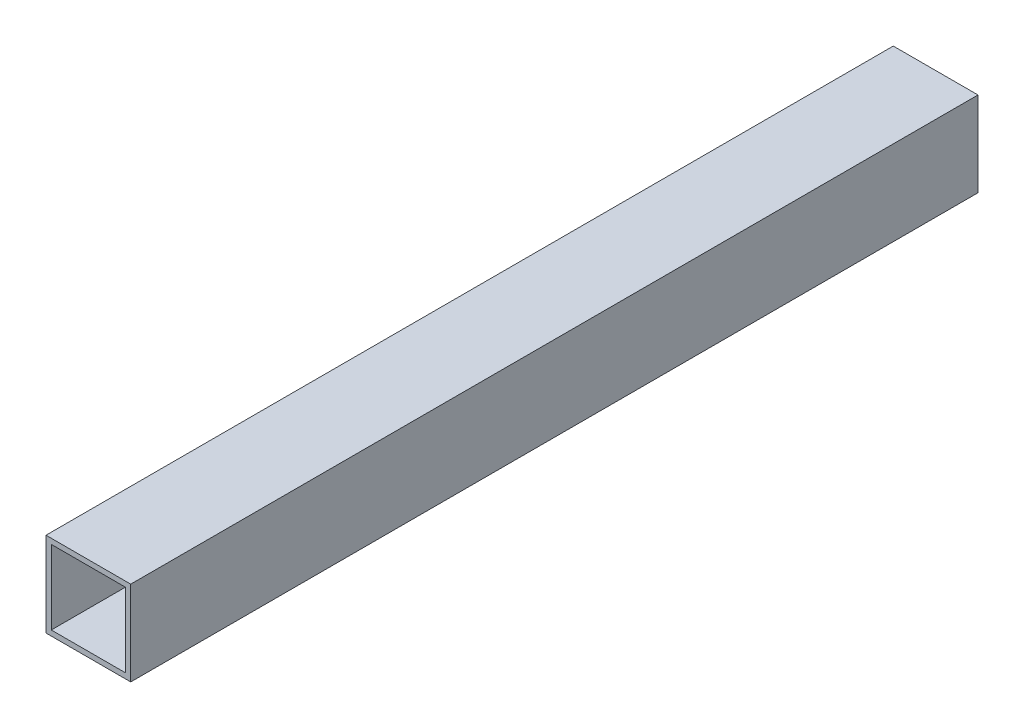
ISO-10303-21;
HEADER;
FILE_DESCRIPTION(('STEP AP214'),'2;1');
FILE_NAME('part.step','',(''),(''),'','','');
FILE_SCHEMA(('AUTOMOTIVE_DESIGN { 1 0 10303 214 1 1 1 1 }'));
ENDSEC;
DATA;
#1=APPLICATION_CONTEXT('core data for automotive mechanical design processes');
#2=APPLICATION_PROTOCOL_DEFINITION('international standard','automotive_design',2000,#1);
#3=PRODUCT_CONTEXT('',#1,'mechanical');
#4=PRODUCT('Part','Part','',(#3));
#5=PRODUCT_RELATED_PRODUCT_CATEGORY('part','',(#4));
#6=PRODUCT_DEFINITION_FORMATION('','',#4);
#7=PRODUCT_DEFINITION_CONTEXT('part definition',#1,'design');
#8=PRODUCT_DEFINITION('design','',#6,#7);
#9=PRODUCT_DEFINITION_SHAPE('','',#8);
#10=(LENGTH_UNIT() NAMED_UNIT(*) SI_UNIT(.MILLI.,.METRE.));
#11=(NAMED_UNIT(*) PLANE_ANGLE_UNIT() SI_UNIT($,.RADIAN.));
#12=(NAMED_UNIT(*) SI_UNIT($,.STERADIAN.) SOLID_ANGLE_UNIT());
#13=UNCERTAINTY_MEASURE_WITH_UNIT(LENGTH_MEASURE(1.E-05),#10,'distance_accuracy_value','');
#14=(GEOMETRIC_REPRESENTATION_CONTEXT(3) GLOBAL_UNCERTAINTY_ASSIGNED_CONTEXT((#13)) GLOBAL_UNIT_ASSIGNED_CONTEXT((#10,
#11,#12)) REPRESENTATION_CONTEXT('',''));
#15=CARTESIAN_POINT('',(0.,0.,0.));
#16=DIRECTION('',(0.,0.,1.));
#17=DIRECTION('',(1.,0.,0.));
#18=AXIS2_PLACEMENT_3D('',#15,#16,#17);
#19=CARTESIAN_POINT('',(0.,0.,508.));
#20=DIRECTION('',(0.,0.,-1.));
#21=DIRECTION('',(-1.,0.,0.));
#22=AXIS2_PLACEMENT_3D('',#19,#20,#21);
#23=PLANE('',#22);
#24=DIRECTION('',(0.,-1.,0.));
#25=VECTOR('',#24,1.);
#26=CARTESIAN_POINT('',(0.,0.,508.));
#27=LINE('',#26,#25);
#28=CARTESIAN_POINT('',(0.,50.8,508.));
#29=VERTEX_POINT('',#28);
#30=CARTESIAN_POINT('',(0.,0.,508.));
#31=VERTEX_POINT('',#30);
#32=EDGE_CURVE('E157',#29,#31,#27,.T.);
#33=ORIENTED_EDGE('',*,*,#32,.T.);
#34=DIRECTION('',(1.,0.,0.));
#35=VECTOR('',#34,1.);
#36=CARTESIAN_POINT('',(0.,0.,508.));
#37=LINE('',#36,#35);
#38=CARTESIAN_POINT('',(50.8,0.,508.));
#39=VERTEX_POINT('',#38);
#40=EDGE_CURVE('E161',#31,#39,#37,.T.);
#41=ORIENTED_EDGE('',*,*,#40,.T.);
#42=DIRECTION('',(0.,1.,0.));
#43=VECTOR('',#42,1.);
#44=CARTESIAN_POINT('',(50.8,0.,508.));
#45=LINE('',#44,#43);
#46=CARTESIAN_POINT('',(50.8,50.8,508.));
#47=VERTEX_POINT('',#46);
#48=EDGE_CURVE('E165',#39,#47,#45,.T.);
#49=ORIENTED_EDGE('',*,*,#48,.T.);
#50=DIRECTION('',(-1.,0.,0.));
#51=VECTOR('',#50,1.);
#52=CARTESIAN_POINT('',(0.,50.8,508.));
#53=LINE('',#52,#51);
#54=EDGE_CURVE('E168',#47,#29,#53,.T.);
#55=ORIENTED_EDGE('',*,*,#54,.T.);
#56=EDGE_LOOP('',(#33,#41,#49,#55));
#57=FACE_BOUND('',#56,.T.);
#58=DIRECTION('',(0.,-1.,0.));
#59=VECTOR('',#58,1.);
#60=CARTESIAN_POINT('',(3.175,3.175,508.));
#61=LINE('',#60,#59);
#62=CARTESIAN_POINT('',(3.175,47.625,508.));
#63=VERTEX_POINT('',#62);
#64=CARTESIAN_POINT('',(3.175,3.175,508.));
#65=VERTEX_POINT('',#64);
#66=EDGE_CURVE('E109',#63,#65,#61,.T.);
#67=ORIENTED_EDGE('',*,*,#66,.F.);
#68=DIRECTION('',(-1.,0.,0.));
#69=VECTOR('',#68,1.);
#70=CARTESIAN_POINT('',(3.175,47.625,508.));
#71=LINE('',#70,#69);
#72=CARTESIAN_POINT('',(47.625,47.625,508.));
#73=VERTEX_POINT('',#72);
#74=EDGE_CURVE('E135',#73,#63,#71,.T.);
#75=ORIENTED_EDGE('',*,*,#74,.F.);
#76=DIRECTION('',(0.,1.,0.));
#77=VECTOR('',#76,1.);
#78=CARTESIAN_POINT('',(47.625,3.175,508.));
#79=LINE('',#78,#77);
#80=CARTESIAN_POINT('',(47.625,3.175,508.));
#81=VERTEX_POINT('',#80);
#82=EDGE_CURVE('E131',#81,#73,#79,.T.);
#83=ORIENTED_EDGE('',*,*,#82,.F.);
#84=DIRECTION('',(1.,0.,0.));
#85=VECTOR('',#84,1.);
#86=CARTESIAN_POINT('',(3.175,3.175,508.));
#87=LINE('',#86,#85);
#88=EDGE_CURVE('E118',#65,#81,#87,.T.);
#89=ORIENTED_EDGE('',*,*,#88,.F.);
#90=EDGE_LOOP('',(#67,#75,#83,#89));
#91=FACE_BOUND('',#90,.T.);
#92=ADVANCED_FACE('F43',(#57,#91),#23,.F.);
#93=CARTESIAN_POINT('',(0.,0.,0.));
#94=DIRECTION('',(0.,0.,-1.));
#95=DIRECTION('',(-1.,0.,0.));
#96=AXIS2_PLACEMENT_3D('',#93,#94,#95);
#97=PLANE('',#96);
#98=DIRECTION('',(0.,-1.,0.));
#99=VECTOR('',#98,1.);
#100=CARTESIAN_POINT('',(0.,0.,0.));
#101=LINE('',#100,#99);
#102=CARTESIAN_POINT('',(0.,50.8,0.));
#103=VERTEX_POINT('',#102);
#104=CARTESIAN_POINT('',(0.,0.,0.));
#105=VERTEX_POINT('',#104);
#106=EDGE_CURVE('E127',#103,#105,#101,.T.);
#107=ORIENTED_EDGE('',*,*,#106,.F.);
#108=DIRECTION('',(-1.,0.,0.));
#109=VECTOR('',#108,1.);
#110=CARTESIAN_POINT('',(0.,50.8,0.));
#111=LINE('',#110,#109);
#112=CARTESIAN_POINT('',(50.8,50.8,0.));
#113=VERTEX_POINT('',#112);
#114=EDGE_CURVE('E162',#113,#103,#111,.T.);
#115=ORIENTED_EDGE('',*,*,#114,.F.);
#116=DIRECTION('',(0.,1.,0.));
#117=VECTOR('',#116,1.);
#118=CARTESIAN_POINT('',(50.8,0.,0.));
#119=LINE('',#118,#117);
#120=CARTESIAN_POINT('',(50.8,0.,0.));
#121=VERTEX_POINT('',#120);
#122=EDGE_CURVE('E178',#121,#113,#119,.T.);
#123=ORIENTED_EDGE('',*,*,#122,.F.);
#124=DIRECTION('',(1.,0.,0.));
#125=VECTOR('',#124,1.);
#126=CARTESIAN_POINT('',(0.,0.,0.));
#127=LINE('',#126,#125);
#128=EDGE_CURVE('E175',#105,#121,#127,.T.);
#129=ORIENTED_EDGE('',*,*,#128,.F.);
#130=EDGE_LOOP('',(#107,#115,#123,#129));
#131=FACE_BOUND('',#130,.T.);
#132=DIRECTION('',(-1.,0.,0.));
#133=VECTOR('',#132,1.);
#134=CARTESIAN_POINT('',(3.175,47.625,0.));
#135=LINE('',#134,#133);
#136=CARTESIAN_POINT('',(47.625,47.625,0.));
#137=VERTEX_POINT('',#136);
#138=CARTESIAN_POINT('',(3.175,47.625,0.));
#139=VERTEX_POINT('',#138);
#140=EDGE_CURVE('E119',#137,#139,#135,.T.);
#141=ORIENTED_EDGE('',*,*,#140,.T.);
#142=DIRECTION('',(0.,-1.,0.));
#143=VECTOR('',#142,1.);
#144=CARTESIAN_POINT('',(3.175,3.175,0.));
#145=LINE('',#144,#143);
#146=CARTESIAN_POINT('',(3.175,3.175,0.));
#147=VERTEX_POINT('',#146);
#148=EDGE_CURVE('E67',#139,#147,#145,.T.);
#149=ORIENTED_EDGE('',*,*,#148,.T.);
#150=DIRECTION('',(1.,0.,0.));
#151=VECTOR('',#150,1.);
#152=CARTESIAN_POINT('',(3.175,3.175,0.));
#153=LINE('',#152,#151);
#154=CARTESIAN_POINT('',(47.625,3.175,0.));
#155=VERTEX_POINT('',#154);
#156=EDGE_CURVE('E125',#147,#155,#153,.T.);
#157=ORIENTED_EDGE('',*,*,#156,.T.);
#158=DIRECTION('',(0.,1.,0.));
#159=VECTOR('',#158,1.);
#160=CARTESIAN_POINT('',(47.625,3.175,0.));
#161=LINE('',#160,#159);
#162=EDGE_CURVE('E144',#155,#137,#161,.T.);
#163=ORIENTED_EDGE('',*,*,#162,.T.);
#164=EDGE_LOOP('',(#141,#149,#157,#163));
#165=FACE_BOUND('',#164,.T.);
#166=ADVANCED_FACE('F201',(#131,#165),#97,.T.);
#167=CARTESIAN_POINT('',(0.,0.,508.));
#168=DIRECTION('',(1.,0.,0.));
#169=DIRECTION('',(0.,0.,-1.));
#170=AXIS2_PLACEMENT_3D('',#167,#168,#169);
#171=PLANE('',#170);
#172=ORIENTED_EDGE('',*,*,#106,.T.);
#173=DIRECTION('',(0.,0.,-1.));
#174=VECTOR('',#173,1.);
#175=CARTESIAN_POINT('',(0.,0.,508.));
#176=LINE('',#175,#174);
#177=EDGE_CURVE('E11',#31,#105,#176,.T.);
#178=ORIENTED_EDGE('',*,*,#177,.F.);
#179=ORIENTED_EDGE('',*,*,#32,.F.);
#180=DIRECTION('',(0.,0.,-1.));
#181=VECTOR('',#180,1.);
#182=CARTESIAN_POINT('',(0.,50.8,508.));
#183=LINE('',#182,#181);
#184=EDGE_CURVE('E171',#29,#103,#183,.T.);
#185=ORIENTED_EDGE('',*,*,#184,.T.);
#186=EDGE_LOOP('',(#172,#178,#179,#185));
#187=FACE_BOUND('',#186,.T.);
#188=ADVANCED_FACE('F45',(#187),#171,.F.);
#189=CARTESIAN_POINT('',(0.,0.,508.));
#190=DIRECTION('',(0.,1.,0.));
#191=DIRECTION('',(0.,0.,1.));
#192=AXIS2_PLACEMENT_3D('',#189,#190,#191);
#193=PLANE('',#192);
#194=ORIENTED_EDGE('',*,*,#128,.T.);
#195=DIRECTION('',(0.,0.,-1.));
#196=VECTOR('',#195,1.);
#197=CARTESIAN_POINT('',(50.8,0.,508.));
#198=LINE('',#197,#196);
#199=EDGE_CURVE('E52',#39,#121,#198,.T.);
#200=ORIENTED_EDGE('',*,*,#199,.F.);
#201=ORIENTED_EDGE('',*,*,#40,.F.);
#202=ORIENTED_EDGE('',*,*,#177,.T.);
#203=EDGE_LOOP('',(#194,#200,#201,#202));
#204=FACE_BOUND('',#203,.T.);
#205=ADVANCED_FACE('F211',(#204),#193,.F.);
#206=CARTESIAN_POINT('',(50.8,0.,508.));
#207=DIRECTION('',(-1.,0.,0.));
#208=DIRECTION('',(0.,0.,1.));
#209=AXIS2_PLACEMENT_3D('',#206,#207,#208);
#210=PLANE('',#209);
#211=ORIENTED_EDGE('',*,*,#122,.T.);
#212=DIRECTION('',(0.,0.,-1.));
#213=VECTOR('',#212,1.);
#214=CARTESIAN_POINT('',(50.8,50.8,508.));
#215=LINE('',#214,#213);
#216=EDGE_CURVE('E186',#47,#113,#215,.T.);
#217=ORIENTED_EDGE('',*,*,#216,.F.);
#218=ORIENTED_EDGE('',*,*,#48,.F.);
#219=ORIENTED_EDGE('',*,*,#199,.T.);
#220=EDGE_LOOP('',(#211,#217,#218,#219));
#221=FACE_BOUND('',#220,.T.);
#222=ADVANCED_FACE('F195',(#221),#210,.F.);
#223=CARTESIAN_POINT('',(0.,50.8,508.));
#224=DIRECTION('',(0.,-1.,0.));
#225=DIRECTION('',(0.,0.,-1.));
#226=AXIS2_PLACEMENT_3D('',#223,#224,#225);
#227=PLANE('',#226);
#228=ORIENTED_EDGE('',*,*,#114,.T.);
#229=ORIENTED_EDGE('',*,*,#184,.F.);
#230=ORIENTED_EDGE('',*,*,#54,.F.);
#231=ORIENTED_EDGE('',*,*,#216,.T.);
#232=EDGE_LOOP('',(#228,#229,#230,#231));
#233=FACE_BOUND('',#232,.T.);
#234=ADVANCED_FACE('F205',(#233),#227,.F.);
#235=CARTESIAN_POINT('',(3.175,3.175,508.));
#236=DIRECTION('',(1.,0.,0.));
#237=DIRECTION('',(0.,0.,-1.));
#238=AXIS2_PLACEMENT_3D('',#235,#236,#237);
#239=PLANE('',#238);
#240=ORIENTED_EDGE('',*,*,#148,.F.);
#241=DIRECTION('',(0.,0.,-1.));
#242=VECTOR('',#241,1.);
#243=CARTESIAN_POINT('',(3.175,47.625,508.));
#244=LINE('',#243,#242);
#245=EDGE_CURVE('E113',#63,#139,#244,.T.);
#246=ORIENTED_EDGE('',*,*,#245,.F.);
#247=ORIENTED_EDGE('',*,*,#66,.T.);
#248=DIRECTION('',(0.,0.,-1.));
#249=VECTOR('',#248,1.);
#250=CARTESIAN_POINT('',(3.175,3.175,508.));
#251=LINE('',#250,#249);
#252=EDGE_CURVE('E112',#65,#147,#251,.T.);
#253=ORIENTED_EDGE('',*,*,#252,.T.);
#254=EDGE_LOOP('',(#240,#246,#247,#253));
#255=FACE_BOUND('',#254,.T.);
#256=ADVANCED_FACE('F111',(#255),#239,.T.);
#257=CARTESIAN_POINT('',(3.175,3.175,508.));
#258=DIRECTION('',(0.,1.,0.));
#259=DIRECTION('',(0.,0.,1.));
#260=AXIS2_PLACEMENT_3D('',#257,#258,#259);
#261=PLANE('',#260);
#262=ORIENTED_EDGE('',*,*,#156,.F.);
#263=ORIENTED_EDGE('',*,*,#252,.F.);
#264=ORIENTED_EDGE('',*,*,#88,.T.);
#265=DIRECTION('',(0.,0.,-1.));
#266=VECTOR('',#265,1.);
#267=CARTESIAN_POINT('',(47.625,3.175,508.));
#268=LINE('',#267,#266);
#269=EDGE_CURVE('E128',#81,#155,#268,.T.);
#270=ORIENTED_EDGE('',*,*,#269,.T.);
#271=EDGE_LOOP('',(#262,#263,#264,#270));
#272=FACE_BOUND('',#271,.T.);
#273=ADVANCED_FACE('F122',(#272),#261,.T.);
#274=CARTESIAN_POINT('',(47.625,3.175,508.));
#275=DIRECTION('',(-1.,0.,0.));
#276=DIRECTION('',(0.,0.,1.));
#277=AXIS2_PLACEMENT_3D('',#274,#275,#276);
#278=PLANE('',#277);
#279=ORIENTED_EDGE('',*,*,#162,.F.);
#280=ORIENTED_EDGE('',*,*,#269,.F.);
#281=ORIENTED_EDGE('',*,*,#82,.T.);
#282=DIRECTION('',(0.,0.,-1.));
#283=VECTOR('',#282,1.);
#284=CARTESIAN_POINT('',(47.625,47.625,508.));
#285=LINE('',#284,#283);
#286=EDGE_CURVE('E59',#73,#137,#285,.T.);
#287=ORIENTED_EDGE('',*,*,#286,.T.);
#288=EDGE_LOOP('',(#279,#280,#281,#287));
#289=FACE_BOUND('',#288,.T.);
#290=ADVANCED_FACE('F234',(#289),#278,.T.);
#291=CARTESIAN_POINT('',(3.175,47.625,508.));
#292=DIRECTION('',(0.,-1.,0.));
#293=DIRECTION('',(0.,0.,-1.));
#294=AXIS2_PLACEMENT_3D('',#291,#292,#293);
#295=PLANE('',#294);
#296=ORIENTED_EDGE('',*,*,#140,.F.);
#297=ORIENTED_EDGE('',*,*,#286,.F.);
#298=ORIENTED_EDGE('',*,*,#74,.T.);
#299=ORIENTED_EDGE('',*,*,#245,.T.);
#300=EDGE_LOOP('',(#296,#297,#298,#299));
#301=FACE_BOUND('',#300,.T.);
#302=ADVANCED_FACE('F238',(#301),#295,.T.);
#303=CLOSED_SHELL('',(#92,#166,#188,#205,#222,#234,#256,#273,#290,#302));
#304=MANIFOLD_SOLID_BREP('B2',#303);
#305=ADVANCED_BREP_SHAPE_REPRESENTATION('',(#18,#304),#14);
#306=SHAPE_DEFINITION_REPRESENTATION(#9,#305);
ENDSEC;
END-ISO-10303-21;
